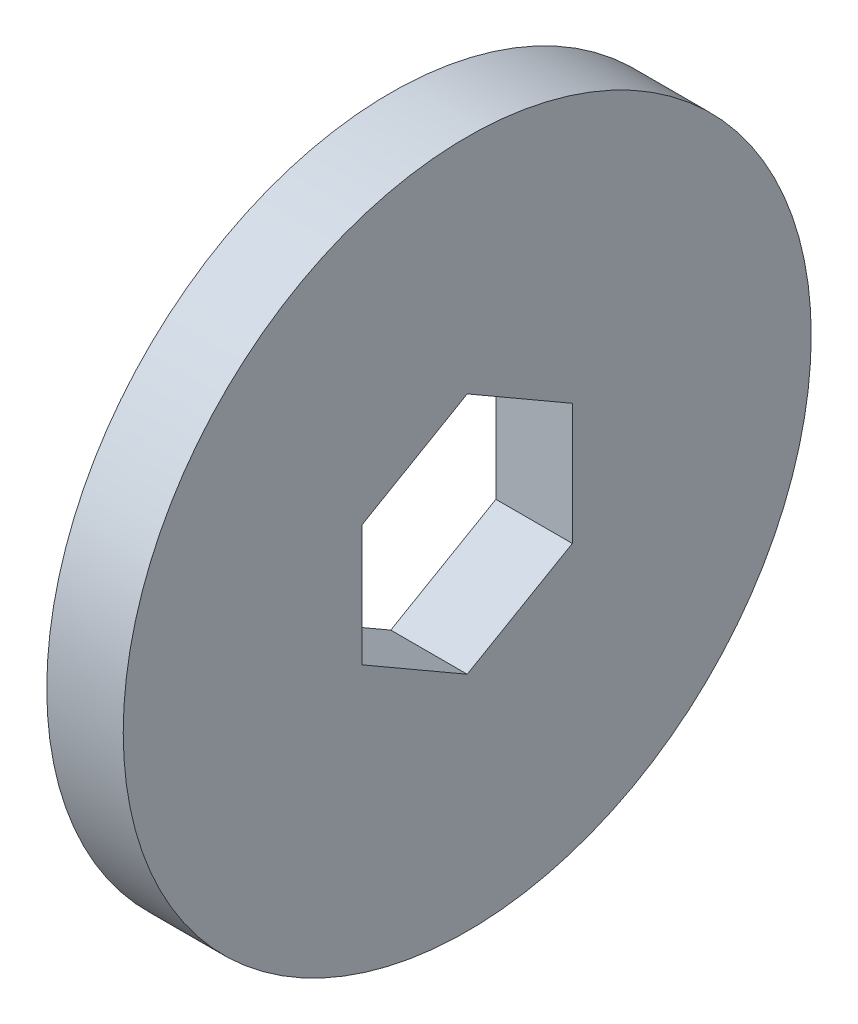
ISO-10303-21;
HEADER;
FILE_DESCRIPTION(('STEP AP214'),'2;1');
FILE_NAME('part.step','',(''),(''),'','','');
FILE_SCHEMA(('AUTOMOTIVE_DESIGN { 1 0 10303 214 1 1 1 1 }'));
ENDSEC;
DATA;
#1=APPLICATION_CONTEXT('core data for automotive mechanical design processes');
#2=APPLICATION_PROTOCOL_DEFINITION('international standard','automotive_design',2000,#1);
#3=PRODUCT_CONTEXT('',#1,'mechanical');
#4=PRODUCT('Part','Part','',(#3));
#5=PRODUCT_RELATED_PRODUCT_CATEGORY('part','',(#4));
#6=PRODUCT_DEFINITION_FORMATION('','',#4);
#7=PRODUCT_DEFINITION_CONTEXT('part definition',#1,'design');
#8=PRODUCT_DEFINITION('design','',#6,#7);
#9=PRODUCT_DEFINITION_SHAPE('','',#8);
#10=(LENGTH_UNIT() NAMED_UNIT(*) SI_UNIT(.MILLI.,.METRE.));
#11=(NAMED_UNIT(*) PLANE_ANGLE_UNIT() SI_UNIT($,.RADIAN.));
#12=(NAMED_UNIT(*) SI_UNIT($,.STERADIAN.) SOLID_ANGLE_UNIT());
#13=UNCERTAINTY_MEASURE_WITH_UNIT(LENGTH_MEASURE(1.E-05),#10,'distance_accuracy_value','');
#14=(GEOMETRIC_REPRESENTATION_CONTEXT(3) GLOBAL_UNCERTAINTY_ASSIGNED_CONTEXT((#13)) GLOBAL_UNIT_ASSIGNED_CONTEXT((#10,
#11,#12)) REPRESENTATION_CONTEXT('',''));
#15=CARTESIAN_POINT('',(0.,0.,0.));
#16=DIRECTION('',(0.,0.,1.));
#17=DIRECTION('',(1.,0.,0.));
#18=AXIS2_PLACEMENT_3D('',#15,#16,#17);
#19=CARTESIAN_POINT('',(2.,0.,0.));
#20=DIRECTION('',(-1.,0.,0.));
#21=DIRECTION('',(0.,0.,1.));
#22=AXIS2_PLACEMENT_3D('',#19,#20,#21);
#23=CYLINDRICAL_SURFACE('',#22,9.);
#24=CARTESIAN_POINT('',(2.,0.,0.));
#25=DIRECTION('',(1.,0.,0.));
#26=DIRECTION('',(0.,0.,-1.));
#27=AXIS2_PLACEMENT_3D('',#24,#25,#26);
#28=CIRCLE('',#27,9.);
#29=CARTESIAN_POINT('',(2.,0.,-9.));
#30=VERTEX_POINT('',#29);
#31=EDGE_CURVE('E11',#30,#30,#28,.T.);
#32=ORIENTED_EDGE('',*,*,#31,.F.);
#33=EDGE_LOOP('',(#32));
#34=FACE_BOUND('',#33,.T.);
#35=CARTESIAN_POINT('',(0.,0.,0.));
#36=DIRECTION('',(1.,0.,0.));
#37=DIRECTION('',(0.,0.,-1.));
#38=AXIS2_PLACEMENT_3D('',#35,#36,#37);
#39=CIRCLE('',#38,9.);
#40=CARTESIAN_POINT('',(0.,0.,-9.));
#41=VERTEX_POINT('',#40);
#42=EDGE_CURVE('E36',#41,#41,#39,.T.);
#43=ORIENTED_EDGE('',*,*,#42,.T.);
#44=EDGE_LOOP('',(#43));
#45=FACE_BOUND('',#44,.T.);
#46=ADVANCED_FACE('F33',(#34,#45),#23,.T.);
#47=CARTESIAN_POINT('',(2.,0.,0.));
#48=DIRECTION('',(1.,0.,0.));
#49=DIRECTION('',(0.,0.,-1.));
#50=AXIS2_PLACEMENT_3D('',#47,#48,#49);
#51=PLANE('',#50);
#52=DIRECTION('',(0.,0.5,0.866025403784439));
#53=VECTOR('',#52,1.);
#54=CARTESIAN_POINT('',(2.,1.58771324027147,-2.75));
#55=LINE('',#54,#53);
#56=CARTESIAN_POINT('',(2.,1.58771324027147,-2.75));
#57=VERTEX_POINT('',#56);
#58=CARTESIAN_POINT('',(2.,3.17542648054294,0.));
#59=VERTEX_POINT('',#58);
#60=EDGE_CURVE('E47',#57,#59,#55,.T.);
#61=ORIENTED_EDGE('',*,*,#60,.F.);
#62=DIRECTION('',(0.,1.,0.));
#63=VECTOR('',#62,1.);
#64=CARTESIAN_POINT('',(2.,-1.58771324027147,-2.75));
#65=LINE('',#64,#63);
#66=CARTESIAN_POINT('',(2.,-1.58771324027147,-2.75));
#67=VERTEX_POINT('',#66);
#68=EDGE_CURVE('E104',#67,#57,#65,.T.);
#69=ORIENTED_EDGE('',*,*,#68,.F.);
#70=DIRECTION('',(0.,0.5,-0.866025403784439));
#71=VECTOR('',#70,1.);
#72=CARTESIAN_POINT('',(2.,-3.17542648054294,0.));
#73=LINE('',#72,#71);
#74=CARTESIAN_POINT('',(2.,-3.17542648054294,0.));
#75=VERTEX_POINT('',#74);
#76=EDGE_CURVE('E107',#75,#67,#73,.T.);
#77=ORIENTED_EDGE('',*,*,#76,.F.);
#78=DIRECTION('',(0.,-0.5,-0.866025403784438));
#79=VECTOR('',#78,1.);
#80=CARTESIAN_POINT('',(2.,-1.58771324027147,2.75));
#81=LINE('',#80,#79);
#82=CARTESIAN_POINT('',(2.,-1.58771324027147,2.75));
#83=VERTEX_POINT('',#82);
#84=EDGE_CURVE('E123',#83,#75,#81,.T.);
#85=ORIENTED_EDGE('',*,*,#84,.F.);
#86=DIRECTION('',(0.,-1.,0.));
#87=VECTOR('',#86,1.);
#88=CARTESIAN_POINT('',(2.,1.58771324027147,2.75));
#89=LINE('',#88,#87);
#90=CARTESIAN_POINT('',(2.,1.58771324027147,2.75));
#91=VERTEX_POINT('',#90);
#92=EDGE_CURVE('E120',#91,#83,#89,.T.);
#93=ORIENTED_EDGE('',*,*,#92,.F.);
#94=DIRECTION('',(0.,-0.5,0.866025403784439));
#95=VECTOR('',#94,1.);
#96=CARTESIAN_POINT('',(2.,3.17542648054294,0.));
#97=LINE('',#96,#95);
#98=EDGE_CURVE('E118',#59,#91,#97,.T.);
#99=ORIENTED_EDGE('',*,*,#98,.F.);
#100=EDGE_LOOP('',(#61,#69,#77,#85,#93,#99));
#101=FACE_BOUND('',#100,.T.);
#102=ORIENTED_EDGE('',*,*,#31,.T.);
#103=EDGE_LOOP('',(#102));
#104=FACE_BOUND('',#103,.T.);
#105=ADVANCED_FACE('F140',(#101,#104),#51,.T.);
#106=CARTESIAN_POINT('',(0.,0.,0.));
#107=DIRECTION('',(1.,0.,0.));
#108=DIRECTION('',(0.,0.,-1.));
#109=AXIS2_PLACEMENT_3D('',#106,#107,#108);
#110=PLANE('',#109);
#111=DIRECTION('',(0.,1.,0.));
#112=VECTOR('',#111,1.);
#113=CARTESIAN_POINT('',(0.,-1.58771324027147,-2.75));
#114=LINE('',#113,#112);
#115=CARTESIAN_POINT('',(0.,-1.58771324027147,-2.75));
#116=VERTEX_POINT('',#115);
#117=CARTESIAN_POINT('',(0.,1.58771324027147,-2.75));
#118=VERTEX_POINT('',#117);
#119=EDGE_CURVE('E93',#116,#118,#114,.T.);
#120=ORIENTED_EDGE('',*,*,#119,.T.);
#121=DIRECTION('',(0.,0.5,0.866025403784439));
#122=VECTOR('',#121,1.);
#123=CARTESIAN_POINT('',(0.,1.58771324027147,-2.75));
#124=LINE('',#123,#122);
#125=CARTESIAN_POINT('',(0.,3.17542648054294,0.));
#126=VERTEX_POINT('',#125);
#127=EDGE_CURVE('E87',#118,#126,#124,.T.);
#128=ORIENTED_EDGE('',*,*,#127,.T.);
#129=DIRECTION('',(0.,-0.5,0.866025403784439));
#130=VECTOR('',#129,1.);
#131=CARTESIAN_POINT('',(0.,3.17542648054294,0.));
#132=LINE('',#131,#130);
#133=CARTESIAN_POINT('',(0.,1.58771324027147,2.75));
#134=VERTEX_POINT('',#133);
#135=EDGE_CURVE('E96',#126,#134,#132,.T.);
#136=ORIENTED_EDGE('',*,*,#135,.T.);
#137=DIRECTION('',(0.,-1.,0.));
#138=VECTOR('',#137,1.);
#139=CARTESIAN_POINT('',(0.,1.58771324027147,2.75));
#140=LINE('',#139,#138);
#141=CARTESIAN_POINT('',(0.,-1.58771324027147,2.75));
#142=VERTEX_POINT('',#141);
#143=EDGE_CURVE('E55',#134,#142,#140,.T.);
#144=ORIENTED_EDGE('',*,*,#143,.T.);
#145=DIRECTION('',(0.,-0.5,-0.866025403784438));
#146=VECTOR('',#145,1.);
#147=CARTESIAN_POINT('',(0.,-1.58771324027147,2.75));
#148=LINE('',#147,#146);
#149=CARTESIAN_POINT('',(0.,-3.17542648054294,0.));
#150=VERTEX_POINT('',#149);
#151=EDGE_CURVE('E111',#142,#150,#148,.T.);
#152=ORIENTED_EDGE('',*,*,#151,.T.);
#153=DIRECTION('',(0.,0.5,-0.866025403784439));
#154=VECTOR('',#153,1.);
#155=CARTESIAN_POINT('',(0.,-3.17542648054294,0.));
#156=LINE('',#155,#154);
#157=EDGE_CURVE('E114',#150,#116,#156,.T.);
#158=ORIENTED_EDGE('',*,*,#157,.T.);
#159=EDGE_LOOP('',(#120,#128,#136,#144,#152,#158));
#160=FACE_BOUND('',#159,.T.);
#161=ORIENTED_EDGE('',*,*,#42,.F.);
#162=EDGE_LOOP('',(#161));
#163=FACE_BOUND('',#162,.T.);
#164=ADVANCED_FACE('F100',(#160,#163),#110,.F.);
#165=CARTESIAN_POINT('',(0.,1.58771324027147,-2.75));
#166=DIRECTION('',(0.,0.866025403784439,-0.5));
#167=DIRECTION('',(0.,0.5,0.866025403784439));
#168=AXIS2_PLACEMENT_3D('',#165,#166,#167);
#169=PLANE('',#168);
#170=ORIENTED_EDGE('',*,*,#60,.T.);
#171=DIRECTION('',(1.,0.,0.));
#172=VECTOR('',#171,1.);
#173=CARTESIAN_POINT('',(0.,3.17542648054294,0.));
#174=LINE('',#173,#172);
#175=EDGE_CURVE('E83',#126,#59,#174,.T.);
#176=ORIENTED_EDGE('',*,*,#175,.F.);
#177=ORIENTED_EDGE('',*,*,#127,.F.);
#178=DIRECTION('',(1.,0.,0.));
#179=VECTOR('',#178,1.);
#180=CARTESIAN_POINT('',(0.,1.58771324027147,-2.75));
#181=LINE('',#180,#179);
#182=EDGE_CURVE('E128',#118,#57,#181,.T.);
#183=ORIENTED_EDGE('',*,*,#182,.T.);
#184=EDGE_LOOP('',(#170,#176,#177,#183));
#185=FACE_BOUND('',#184,.T.);
#186=ADVANCED_FACE('F85',(#185),#169,.F.);
#187=CARTESIAN_POINT('',(0.,-1.58771324027147,-2.75));
#188=DIRECTION('',(0.,0.,-1.));
#189=DIRECTION('',(0.,1.,0.));
#190=AXIS2_PLACEMENT_3D('',#187,#188,#189);
#191=PLANE('',#190);
#192=ORIENTED_EDGE('',*,*,#68,.T.);
#193=ORIENTED_EDGE('',*,*,#182,.F.);
#194=ORIENTED_EDGE('',*,*,#119,.F.);
#195=DIRECTION('',(1.,0.,0.));
#196=VECTOR('',#195,1.);
#197=CARTESIAN_POINT('',(0.,-1.58771324027147,-2.75));
#198=LINE('',#197,#196);
#199=EDGE_CURVE('E130',#116,#67,#198,.T.);
#200=ORIENTED_EDGE('',*,*,#199,.T.);
#201=EDGE_LOOP('',(#192,#193,#194,#200));
#202=FACE_BOUND('',#201,.T.);
#203=ADVANCED_FACE('F151',(#202),#191,.F.);
#204=CARTESIAN_POINT('',(0.,-3.17542648054294,0.));
#205=DIRECTION('',(0.,-0.866025403784439,-0.5));
#206=DIRECTION('',(0.,0.5,-0.866025403784439));
#207=AXIS2_PLACEMENT_3D('',#204,#205,#206);
#208=PLANE('',#207);
#209=ORIENTED_EDGE('',*,*,#76,.T.);
#210=ORIENTED_EDGE('',*,*,#199,.F.);
#211=ORIENTED_EDGE('',*,*,#157,.F.);
#212=DIRECTION('',(1.,0.,0.));
#213=VECTOR('',#212,1.);
#214=CARTESIAN_POINT('',(0.,-3.17542648054294,0.));
#215=LINE('',#214,#213);
#216=EDGE_CURVE('E132',#150,#75,#215,.T.);
#217=ORIENTED_EDGE('',*,*,#216,.T.);
#218=EDGE_LOOP('',(#209,#210,#211,#217));
#219=FACE_BOUND('',#218,.T.);
#220=ADVANCED_FACE('F149',(#219),#208,.F.);
#221=CARTESIAN_POINT('',(0.,-1.58771324027147,2.75));
#222=DIRECTION('',(0.,-0.866025403784439,0.5));
#223=DIRECTION('',(0.,-0.5,-0.866025403784439));
#224=AXIS2_PLACEMENT_3D('',#221,#222,#223);
#225=PLANE('',#224);
#226=ORIENTED_EDGE('',*,*,#84,.T.);
#227=ORIENTED_EDGE('',*,*,#216,.F.);
#228=ORIENTED_EDGE('',*,*,#151,.F.);
#229=DIRECTION('',(1.,0.,0.));
#230=VECTOR('',#229,1.);
#231=CARTESIAN_POINT('',(0.,-1.58771324027147,2.75));
#232=LINE('',#231,#230);
#233=EDGE_CURVE('E134',#142,#83,#232,.T.);
#234=ORIENTED_EDGE('',*,*,#233,.T.);
#235=EDGE_LOOP('',(#226,#227,#228,#234));
#236=FACE_BOUND('',#235,.T.);
#237=ADVANCED_FACE('F145',(#236),#225,.F.);
#238=CARTESIAN_POINT('',(0.,1.58771324027147,2.75));
#239=DIRECTION('',(0.,0.,1.));
#240=DIRECTION('',(1.,0.,0.));
#241=AXIS2_PLACEMENT_3D('',#238,#239,#240);
#242=PLANE('',#241);
#243=ORIENTED_EDGE('',*,*,#92,.T.);
#244=ORIENTED_EDGE('',*,*,#233,.F.);
#245=ORIENTED_EDGE('',*,*,#143,.F.);
#246=DIRECTION('',(1.,0.,0.));
#247=VECTOR('',#246,1.);
#248=CARTESIAN_POINT('',(0.,1.58771324027147,2.75));
#249=LINE('',#248,#247);
#250=EDGE_CURVE('E92',#134,#91,#249,.T.);
#251=ORIENTED_EDGE('',*,*,#250,.T.);
#252=EDGE_LOOP('',(#243,#244,#245,#251));
#253=FACE_BOUND('',#252,.T.);
#254=ADVANCED_FACE('F136',(#253),#242,.F.);
#255=CARTESIAN_POINT('',(0.,3.17542648054294,0.));
#256=DIRECTION('',(0.,0.866025403784439,0.5));
#257=DIRECTION('',(0.,-0.5,0.866025403784439));
#258=AXIS2_PLACEMENT_3D('',#255,#256,#257);
#259=PLANE('',#258);
#260=ORIENTED_EDGE('',*,*,#98,.T.);
#261=ORIENTED_EDGE('',*,*,#250,.F.);
#262=ORIENTED_EDGE('',*,*,#135,.F.);
#263=ORIENTED_EDGE('',*,*,#175,.T.);
#264=EDGE_LOOP('',(#260,#261,#262,#263));
#265=FACE_BOUND('',#264,.T.);
#266=ADVANCED_FACE('F97',(#265),#259,.F.);
#267=CLOSED_SHELL('',(#46,#105,#164,#186,#203,#220,#237,#254,#266));
#268=MANIFOLD_SOLID_BREP('B2',#267);
#269=ADVANCED_BREP_SHAPE_REPRESENTATION('',(#18,#268),#14);
#270=SHAPE_DEFINITION_REPRESENTATION(#9,#269);
ENDSEC;
END-ISO-10303-21;
